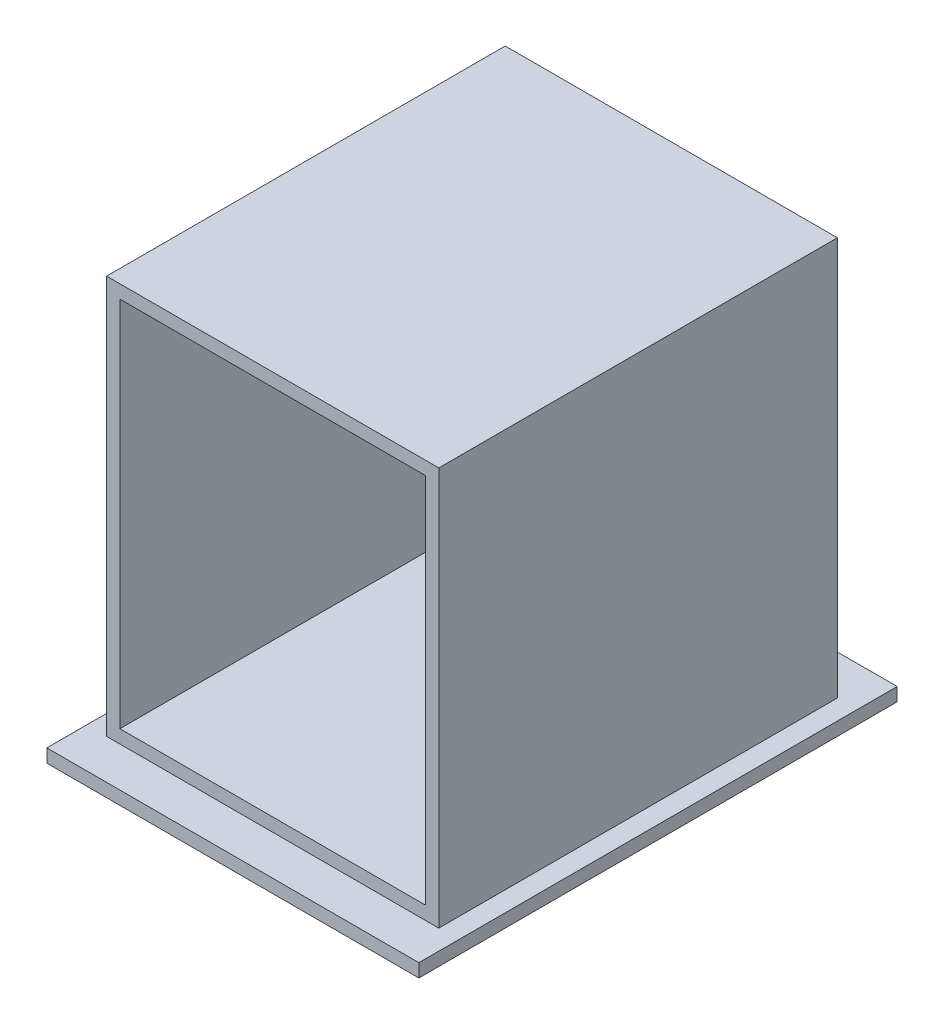
ISO-10303-21;
HEADER;
FILE_DESCRIPTION(('STEP AP214'),'2;1');
FILE_NAME('part.step','',(''),(''),'','','');
FILE_SCHEMA(('AUTOMOTIVE_DESIGN { 1 0 10303 214 1 1 1 1 }'));
ENDSEC;
DATA;
#1=APPLICATION_CONTEXT('core data for automotive mechanical design processes');
#2=APPLICATION_PROTOCOL_DEFINITION('international standard','automotive_design',2000,#1);
#3=PRODUCT_CONTEXT('',#1,'mechanical');
#4=PRODUCT('Part','Part','',(#3));
#5=PRODUCT_RELATED_PRODUCT_CATEGORY('part','',(#4));
#6=PRODUCT_DEFINITION_FORMATION('','',#4);
#7=PRODUCT_DEFINITION_CONTEXT('part definition',#1,'design');
#8=PRODUCT_DEFINITION('design','',#6,#7);
#9=PRODUCT_DEFINITION_SHAPE('','',#8);
#10=(LENGTH_UNIT() NAMED_UNIT(*) SI_UNIT(.MILLI.,.METRE.));
#11=(NAMED_UNIT(*) PLANE_ANGLE_UNIT() SI_UNIT($,.RADIAN.));
#12=(NAMED_UNIT(*) SI_UNIT($,.STERADIAN.) SOLID_ANGLE_UNIT());
#13=UNCERTAINTY_MEASURE_WITH_UNIT(LENGTH_MEASURE(1.E-05),#10,'distance_accuracy_value','');
#14=(GEOMETRIC_REPRESENTATION_CONTEXT(3) GLOBAL_UNCERTAINTY_ASSIGNED_CONTEXT((#13)) GLOBAL_UNIT_ASSIGNED_CONTEXT((#10,
#11,#12)) REPRESENTATION_CONTEXT('',''));
#15=CARTESIAN_POINT('',(0.,0.,0.));
#16=DIRECTION('',(0.,0.,1.));
#17=DIRECTION('',(1.,0.,0.));
#18=AXIS2_PLACEMENT_3D('',#15,#16,#17);
#19=CARTESIAN_POINT('',(0.,0.,300.));
#20=DIRECTION('',(1.,0.,0.));
#21=DIRECTION('',(0.,0.,-1.));
#22=AXIS2_PLACEMENT_3D('',#19,#20,#21);
#23=PLANE('',#22);
#24=DIRECTION('',(0.,-1.,0.));
#25=VECTOR('',#24,1.);
#26=CARTESIAN_POINT('',(0.,0.,0.));
#27=LINE('',#26,#25);
#28=CARTESIAN_POINT('',(0.,300.,0.));
#29=VERTEX_POINT('',#28);
#30=CARTESIAN_POINT('',(0.,0.,0.));
#31=VERTEX_POINT('',#30);
#32=EDGE_CURVE('E238',#29,#31,#27,.T.);
#33=ORIENTED_EDGE('',*,*,#32,.T.);
#34=DIRECTION('',(0.,0.,-1.));
#35=VECTOR('',#34,1.);
#36=CARTESIAN_POINT('',(0.,0.,300.));
#37=LINE('',#36,#35);
#38=CARTESIAN_POINT('',(0.,0.,300.));
#39=VERTEX_POINT('',#38);
#40=EDGE_CURVE('E11',#39,#31,#37,.T.);
#41=ORIENTED_EDGE('',*,*,#40,.F.);
#42=DIRECTION('',(0.,-1.,0.));
#43=VECTOR('',#42,1.);
#44=CARTESIAN_POINT('',(0.,0.,300.));
#45=LINE('',#44,#43);
#46=CARTESIAN_POINT('',(0.,300.,300.));
#47=VERTEX_POINT('',#46);
#48=EDGE_CURVE('E244',#47,#39,#45,.T.);
#49=ORIENTED_EDGE('',*,*,#48,.F.);
#50=DIRECTION('',(0.,0.,-1.));
#51=VECTOR('',#50,1.);
#52=CARTESIAN_POINT('',(0.,300.,300.));
#53=LINE('',#52,#51);
#54=EDGE_CURVE('E253',#47,#29,#53,.T.);
#55=ORIENTED_EDGE('',*,*,#54,.T.);
#56=EDGE_LOOP('',(#33,#41,#49,#55));
#57=FACE_BOUND('',#56,.T.);
#58=ADVANCED_FACE('F33',(#57),#23,.F.);
#59=CARTESIAN_POINT('',(250.,0.,300.));
#60=DIRECTION('',(-1.,0.,0.));
#61=DIRECTION('',(0.,-1.,0.));
#62=AXIS2_PLACEMENT_3D('',#59,#60,#61);
#63=PLANE('',#62);
#64=DIRECTION('',(0.,1.,0.));
#65=VECTOR('',#64,1.);
#66=CARTESIAN_POINT('',(250.,0.,0.));
#67=LINE('',#66,#65);
#68=CARTESIAN_POINT('',(250.,0.,0.));
#69=VERTEX_POINT('',#68);
#70=CARTESIAN_POINT('',(250.,300.,0.));
#71=VERTEX_POINT('',#70);
#72=EDGE_CURVE('E258',#69,#71,#67,.T.);
#73=ORIENTED_EDGE('',*,*,#72,.T.);
#74=DIRECTION('',(0.,0.,-1.));
#75=VECTOR('',#74,1.);
#76=CARTESIAN_POINT('',(250.,300.,300.));
#77=LINE('',#76,#75);
#78=CARTESIAN_POINT('',(250.,300.,300.));
#79=VERTEX_POINT('',#78);
#80=EDGE_CURVE('E263',#79,#71,#77,.T.);
#81=ORIENTED_EDGE('',*,*,#80,.F.);
#82=DIRECTION('',(0.,1.,0.));
#83=VECTOR('',#82,1.);
#84=CARTESIAN_POINT('',(250.,0.,300.));
#85=LINE('',#84,#83);
#86=CARTESIAN_POINT('',(250.,0.,300.));
#87=VERTEX_POINT('',#86);
#88=EDGE_CURVE('E249',#87,#79,#85,.T.);
#89=ORIENTED_EDGE('',*,*,#88,.F.);
#90=DIRECTION('',(0.,0.,-1.));
#91=VECTOR('',#90,1.);
#92=CARTESIAN_POINT('',(250.,0.,300.));
#93=LINE('',#92,#91);
#94=EDGE_CURVE('E40',#87,#69,#93,.T.);
#95=ORIENTED_EDGE('',*,*,#94,.T.);
#96=EDGE_LOOP('',(#73,#81,#89,#95));
#97=FACE_BOUND('',#96,.T.);
#98=ADVANCED_FACE('F269',(#97),#63,.F.);
#99=CARTESIAN_POINT('',(0.,300.,300.));
#100=DIRECTION('',(0.,-1.,0.));
#101=DIRECTION('',(0.,0.,-1.));
#102=AXIS2_PLACEMENT_3D('',#99,#100,#101);
#103=PLANE('',#102);
#104=DIRECTION('',(-1.,0.,0.));
#105=VECTOR('',#104,1.);
#106=CARTESIAN_POINT('',(0.,300.,0.));
#107=LINE('',#106,#105);
#108=EDGE_CURVE('E247',#71,#29,#107,.T.);
#109=ORIENTED_EDGE('',*,*,#108,.T.);
#110=ORIENTED_EDGE('',*,*,#54,.F.);
#111=DIRECTION('',(-1.,0.,0.));
#112=VECTOR('',#111,1.);
#113=CARTESIAN_POINT('',(0.,300.,300.));
#114=LINE('',#113,#112);
#115=EDGE_CURVE('E251',#79,#47,#114,.T.);
#116=ORIENTED_EDGE('',*,*,#115,.F.);
#117=ORIENTED_EDGE('',*,*,#80,.T.);
#118=EDGE_LOOP('',(#109,#110,#116,#117));
#119=FACE_BOUND('',#118,.T.);
#120=ADVANCED_FACE('F285',(#119),#103,.F.);
#121=CARTESIAN_POINT('',(0.,0.,300.));
#122=DIRECTION('',(0.,0.,-1.));
#123=DIRECTION('',(-1.,0.,0.));
#124=AXIS2_PLACEMENT_3D('',#121,#122,#123);
#125=PLANE('',#124);
#126=DIRECTION('',(1.,0.,0.));
#127=VECTOR('',#126,1.);
#128=CARTESIAN_POINT('',(10.,10.,300.));
#129=LINE('',#128,#127);
#130=CARTESIAN_POINT('',(10.,10.,300.));
#131=VERTEX_POINT('',#130);
#132=CARTESIAN_POINT('',(240.,10.,300.));
#133=VERTEX_POINT('',#132);
#134=EDGE_CURVE('E228',#131,#133,#129,.T.);
#135=ORIENTED_EDGE('',*,*,#134,.F.);
#136=DIRECTION('',(0.,-1.,0.));
#137=VECTOR('',#136,1.);
#138=CARTESIAN_POINT('',(10.,10.,300.));
#139=LINE('',#138,#137);
#140=CARTESIAN_POINT('',(10.,290.,300.));
#141=VERTEX_POINT('',#140);
#142=EDGE_CURVE('E55',#141,#131,#139,.T.);
#143=ORIENTED_EDGE('',*,*,#142,.F.);
#144=DIRECTION('',(-1.,0.,0.));
#145=VECTOR('',#144,1.);
#146=CARTESIAN_POINT('',(10.,290.,300.));
#147=LINE('',#146,#145);
#148=CARTESIAN_POINT('',(240.,290.,300.));
#149=VERTEX_POINT('',#148);
#150=EDGE_CURVE('E217',#149,#141,#147,.T.);
#151=ORIENTED_EDGE('',*,*,#150,.F.);
#152=DIRECTION('',(0.,1.,0.));
#153=VECTOR('',#152,1.);
#154=CARTESIAN_POINT('',(240.,10.,300.));
#155=LINE('',#154,#153);
#156=EDGE_CURVE('E231',#133,#149,#155,.T.);
#157=ORIENTED_EDGE('',*,*,#156,.F.);
#158=EDGE_LOOP('',(#135,#143,#151,#157));
#159=FACE_BOUND('',#158,.T.);
#160=ORIENTED_EDGE('',*,*,#48,.T.);
#161=DIRECTION('',(1.,0.,0.));
#162=VECTOR('',#161,1.);
#163=CARTESIAN_POINT('',(0.,0.,300.));
#164=LINE('',#163,#162);
#165=EDGE_CURVE('E246',#39,#87,#164,.T.);
#166=ORIENTED_EDGE('',*,*,#165,.T.);
#167=ORIENTED_EDGE('',*,*,#88,.T.);
#168=ORIENTED_EDGE('',*,*,#115,.T.);
#169=EDGE_LOOP('',(#160,#166,#167,#168));
#170=FACE_BOUND('',#169,.T.);
#171=ADVANCED_FACE('F287',(#159,#170),#125,.F.);
#172=CARTESIAN_POINT('',(0.,0.,0.));
#173=DIRECTION('',(0.,0.,-1.));
#174=DIRECTION('',(-1.,0.,0.));
#175=AXIS2_PLACEMENT_3D('',#172,#173,#174);
#176=PLANE('',#175);
#177=ORIENTED_EDGE('',*,*,#32,.F.);
#178=ORIENTED_EDGE('',*,*,#108,.F.);
#179=ORIENTED_EDGE('',*,*,#72,.F.);
#180=DIRECTION('',(1.,0.,0.));
#181=VECTOR('',#180,1.);
#182=CARTESIAN_POINT('',(0.,0.,0.));
#183=LINE('',#182,#181);
#184=EDGE_CURVE('E255',#31,#69,#183,.T.);
#185=ORIENTED_EDGE('',*,*,#184,.F.);
#186=EDGE_LOOP('',(#177,#178,#179,#185));
#187=FACE_BOUND('',#186,.T.);
#188=ADVANCED_FACE('F277',(#187),#176,.T.);
#189=CARTESIAN_POINT('',(10.,10.,10.));
#190=DIRECTION('',(-1.,0.,0.));
#191=DIRECTION('',(0.,-1.,0.));
#192=AXIS2_PLACEMENT_3D('',#189,#190,#191);
#193=PLANE('',#192);
#194=ORIENTED_EDGE('',*,*,#142,.T.);
#195=DIRECTION('',(0.,0.,1.));
#196=VECTOR('',#195,1.);
#197=CARTESIAN_POINT('',(10.,10.,10.));
#198=LINE('',#197,#196);
#199=CARTESIAN_POINT('',(10.,10.,10.));
#200=VERTEX_POINT('',#199);
#201=EDGE_CURVE('E226',#200,#131,#198,.T.);
#202=ORIENTED_EDGE('',*,*,#201,.F.);
#203=DIRECTION('',(0.,-1.,0.));
#204=VECTOR('',#203,1.);
#205=CARTESIAN_POINT('',(10.,10.,10.));
#206=LINE('',#205,#204);
#207=CARTESIAN_POINT('',(10.,290.,10.));
#208=VERTEX_POINT('',#207);
#209=EDGE_CURVE('E213',#208,#200,#206,.T.);
#210=ORIENTED_EDGE('',*,*,#209,.F.);
#211=DIRECTION('',(0.,0.,1.));
#212=VECTOR('',#211,1.);
#213=CARTESIAN_POINT('',(10.,290.,10.));
#214=LINE('',#213,#212);
#215=EDGE_CURVE('E236',#208,#141,#214,.T.);
#216=ORIENTED_EDGE('',*,*,#215,.T.);
#217=EDGE_LOOP('',(#194,#202,#210,#216));
#218=FACE_BOUND('',#217,.T.);
#219=ADVANCED_FACE('F295',(#218),#193,.F.);
#220=CARTESIAN_POINT('',(10.,290.,10.));
#221=DIRECTION('',(0.,1.,0.));
#222=DIRECTION('',(0.,0.,1.));
#223=AXIS2_PLACEMENT_3D('',#220,#221,#222);
#224=PLANE('',#223);
#225=ORIENTED_EDGE('',*,*,#150,.T.);
#226=ORIENTED_EDGE('',*,*,#215,.F.);
#227=DIRECTION('',(-1.,0.,0.));
#228=VECTOR('',#227,1.);
#229=CARTESIAN_POINT('',(10.,290.,10.));
#230=LINE('',#229,#228);
#231=CARTESIAN_POINT('',(240.,290.,10.));
#232=VERTEX_POINT('',#231);
#233=EDGE_CURVE('E223',#232,#208,#230,.T.);
#234=ORIENTED_EDGE('',*,*,#233,.F.);
#235=DIRECTION('',(0.,0.,1.));
#236=VECTOR('',#235,1.);
#237=CARTESIAN_POINT('',(240.,290.,10.));
#238=LINE('',#237,#236);
#239=EDGE_CURVE('E239',#232,#149,#238,.T.);
#240=ORIENTED_EDGE('',*,*,#239,.T.);
#241=EDGE_LOOP('',(#225,#226,#234,#240));
#242=FACE_BOUND('',#241,.T.);
#243=ADVANCED_FACE('F333',(#242),#224,.F.);
#244=CARTESIAN_POINT('',(240.,10.,10.));
#245=DIRECTION('',(1.,0.,0.));
#246=DIRECTION('',(0.,0.,-1.));
#247=AXIS2_PLACEMENT_3D('',#244,#245,#246);
#248=PLANE('',#247);
#249=ORIENTED_EDGE('',*,*,#156,.T.);
#250=ORIENTED_EDGE('',*,*,#239,.F.);
#251=DIRECTION('',(0.,1.,0.));
#252=VECTOR('',#251,1.);
#253=CARTESIAN_POINT('',(240.,10.,10.));
#254=LINE('',#253,#252);
#255=CARTESIAN_POINT('',(240.,10.,10.));
#256=VERTEX_POINT('',#255);
#257=EDGE_CURVE('E220',#256,#232,#254,.T.);
#258=ORIENTED_EDGE('',*,*,#257,.F.);
#259=DIRECTION('',(0.,0.,1.));
#260=VECTOR('',#259,1.);
#261=CARTESIAN_POINT('',(240.,10.,10.));
#262=LINE('',#261,#260);
#263=EDGE_CURVE('E241',#256,#133,#262,.T.);
#264=ORIENTED_EDGE('',*,*,#263,.T.);
#265=EDGE_LOOP('',(#249,#250,#258,#264));
#266=FACE_BOUND('',#265,.T.);
#267=ADVANCED_FACE('F338',(#266),#248,.F.);
#268=CARTESIAN_POINT('',(10.,10.,10.));
#269=DIRECTION('',(0.,-1.,0.));
#270=DIRECTION('',(0.,0.,-1.));
#271=AXIS2_PLACEMENT_3D('',#268,#269,#270);
#272=PLANE('',#271);
#273=ORIENTED_EDGE('',*,*,#134,.T.);
#274=ORIENTED_EDGE('',*,*,#263,.F.);
#275=DIRECTION('',(1.,0.,0.));
#276=VECTOR('',#275,1.);
#277=CARTESIAN_POINT('',(10.,10.,10.));
#278=LINE('',#277,#276);
#279=EDGE_CURVE('E216',#200,#256,#278,.T.);
#280=ORIENTED_EDGE('',*,*,#279,.F.);
#281=ORIENTED_EDGE('',*,*,#201,.T.);
#282=EDGE_LOOP('',(#273,#274,#280,#281));
#283=FACE_BOUND('',#282,.T.);
#284=ADVANCED_FACE('F346',(#283),#272,.F.);
#285=CARTESIAN_POINT('',(0.,0.,10.));
#286=DIRECTION('',(0.,0.,-1.));
#287=DIRECTION('',(-1.,0.,0.));
#288=AXIS2_PLACEMENT_3D('',#285,#286,#287);
#289=PLANE('',#288);
#290=ORIENTED_EDGE('',*,*,#209,.T.);
#291=ORIENTED_EDGE('',*,*,#279,.T.);
#292=ORIENTED_EDGE('',*,*,#257,.T.);
#293=ORIENTED_EDGE('',*,*,#233,.T.);
#294=EDGE_LOOP('',(#290,#291,#292,#293));
#295=FACE_BOUND('',#294,.T.);
#296=ADVANCED_FACE('F354',(#295),#289,.F.);
#297=CARTESIAN_POINT('',(0.,0.,0.));
#298=DIRECTION('',(0.,-1.,0.));
#299=DIRECTION('',(0.,0.,-1.));
#300=AXIS2_PLACEMENT_3D('',#297,#298,#299);
#301=PLANE('',#300);
#302=DIRECTION('',(0.,0.,-1.));
#303=VECTOR('',#302,1.);
#304=CARTESIAN_POINT('',(-15.,0.,330.));
#305=LINE('',#304,#303);
#306=CARTESIAN_POINT('',(-15.,0.,330.));
#307=VERTEX_POINT('',#306);
#308=CARTESIAN_POINT('',(-15.,0.,-30.));
#309=VERTEX_POINT('',#308);
#310=EDGE_CURVE('E180',#307,#309,#305,.T.);
#311=ORIENTED_EDGE('',*,*,#310,.F.);
#312=DIRECTION('',(-1.,0.,0.));
#313=VECTOR('',#312,1.);
#314=CARTESIAN_POINT('',(-15.,0.,330.));
#315=LINE('',#314,#313);
#316=CARTESIAN_POINT('',(265.,0.,330.));
#317=VERTEX_POINT('',#316);
#318=EDGE_CURVE('E188',#317,#307,#315,.T.);
#319=ORIENTED_EDGE('',*,*,#318,.F.);
#320=DIRECTION('',(0.,0.,1.));
#321=VECTOR('',#320,1.);
#322=CARTESIAN_POINT('',(265.,0.,330.));
#323=LINE('',#322,#321);
#324=CARTESIAN_POINT('',(265.,0.,-30.));
#325=VERTEX_POINT('',#324);
#326=EDGE_CURVE('E199',#325,#317,#323,.T.);
#327=ORIENTED_EDGE('',*,*,#326,.F.);
#328=DIRECTION('',(1.,0.,0.));
#329=VECTOR('',#328,1.);
#330=CARTESIAN_POINT('',(-15.,0.,-30.));
#331=LINE('',#330,#329);
#332=EDGE_CURVE('E197',#309,#325,#331,.T.);
#333=ORIENTED_EDGE('',*,*,#332,.F.);
#334=EDGE_LOOP('',(#311,#319,#327,#333));
#335=FACE_BOUND('',#334,.T.);
#336=ORIENTED_EDGE('',*,*,#40,.T.);
#337=ORIENTED_EDGE('',*,*,#184,.T.);
#338=ORIENTED_EDGE('',*,*,#94,.F.);
#339=ORIENTED_EDGE('',*,*,#165,.F.);
#340=EDGE_LOOP('',(#336,#337,#338,#339));
#341=FACE_BOUND('',#340,.T.);
#342=ADVANCED_FACE('F278',(#335,#341),#301,.F.);
#343=CARTESIAN_POINT('',(-15.,-10.,330.));
#344=DIRECTION('',(1.,0.,0.));
#345=DIRECTION('',(0.,0.,-1.));
#346=AXIS2_PLACEMENT_3D('',#343,#344,#345);
#347=PLANE('',#346);
#348=ORIENTED_EDGE('',*,*,#310,.T.);
#349=DIRECTION('',(0.,1.,0.));
#350=VECTOR('',#349,1.);
#351=CARTESIAN_POINT('',(-15.,-10.,-30.));
#352=LINE('',#351,#350);
#353=CARTESIAN_POINT('',(-15.,-10.,-30.));
#354=VERTEX_POINT('',#353);
#355=EDGE_CURVE('E210',#354,#309,#352,.T.);
#356=ORIENTED_EDGE('',*,*,#355,.F.);
#357=DIRECTION('',(0.,0.,-1.));
#358=VECTOR('',#357,1.);
#359=CARTESIAN_POINT('',(-15.,-10.,330.));
#360=LINE('',#359,#358);
#361=CARTESIAN_POINT('',(-15.,-10.,330.));
#362=VERTEX_POINT('',#361);
#363=EDGE_CURVE('E184',#362,#354,#360,.T.);
#364=ORIENTED_EDGE('',*,*,#363,.F.);
#365=DIRECTION('',(0.,1.,0.));
#366=VECTOR('',#365,1.);
#367=CARTESIAN_POINT('',(-15.,-10.,330.));
#368=LINE('',#367,#366);
#369=EDGE_CURVE('E194',#362,#307,#368,.T.);
#370=ORIENTED_EDGE('',*,*,#369,.T.);
#371=EDGE_LOOP('',(#348,#356,#364,#370));
#372=FACE_BOUND('',#371,.T.);
#373=ADVANCED_FACE('F367',(#372),#347,.F.);
#374=CARTESIAN_POINT('',(-15.,-10.,-30.));
#375=DIRECTION('',(0.,0.,1.));
#376=DIRECTION('',(1.,0.,0.));
#377=AXIS2_PLACEMENT_3D('',#374,#375,#376);
#378=PLANE('',#377);
#379=ORIENTED_EDGE('',*,*,#332,.T.);
#380=DIRECTION('',(0.,1.,0.));
#381=VECTOR('',#380,1.);
#382=CARTESIAN_POINT('',(265.,-10.,-30.));
#383=LINE('',#382,#381);
#384=CARTESIAN_POINT('',(265.,-10.,-30.));
#385=VERTEX_POINT('',#384);
#386=EDGE_CURVE('E207',#385,#325,#383,.T.);
#387=ORIENTED_EDGE('',*,*,#386,.F.);
#388=DIRECTION('',(1.,0.,0.));
#389=VECTOR('',#388,1.);
#390=CARTESIAN_POINT('',(-15.,-10.,-30.));
#391=LINE('',#390,#389);
#392=EDGE_CURVE('E187',#354,#385,#391,.T.);
#393=ORIENTED_EDGE('',*,*,#392,.F.);
#394=ORIENTED_EDGE('',*,*,#355,.T.);
#395=EDGE_LOOP('',(#379,#387,#393,#394));
#396=FACE_BOUND('',#395,.T.);
#397=ADVANCED_FACE('F375',(#396),#378,.F.);
#398=CARTESIAN_POINT('',(265.,-10.,330.));
#399=DIRECTION('',(-1.,0.,0.));
#400=DIRECTION('',(0.,0.,1.));
#401=AXIS2_PLACEMENT_3D('',#398,#399,#400);
#402=PLANE('',#401);
#403=ORIENTED_EDGE('',*,*,#326,.T.);
#404=DIRECTION('',(0.,1.,0.));
#405=VECTOR('',#404,1.);
#406=CARTESIAN_POINT('',(265.,-10.,330.));
#407=LINE('',#406,#405);
#408=CARTESIAN_POINT('',(265.,-10.,330.));
#409=VERTEX_POINT('',#408);
#410=EDGE_CURVE('E204',#409,#317,#407,.T.);
#411=ORIENTED_EDGE('',*,*,#410,.F.);
#412=DIRECTION('',(0.,0.,1.));
#413=VECTOR('',#412,1.);
#414=CARTESIAN_POINT('',(265.,-10.,330.));
#415=LINE('',#414,#413);
#416=EDGE_CURVE('E190',#385,#409,#415,.T.);
#417=ORIENTED_EDGE('',*,*,#416,.F.);
#418=ORIENTED_EDGE('',*,*,#386,.T.);
#419=EDGE_LOOP('',(#403,#411,#417,#418));
#420=FACE_BOUND('',#419,.T.);
#421=ADVANCED_FACE('F383',(#420),#402,.F.);
#422=CARTESIAN_POINT('',(-15.,-10.,330.));
#423=DIRECTION('',(0.,0.,-1.));
#424=DIRECTION('',(-1.,0.,0.));
#425=AXIS2_PLACEMENT_3D('',#422,#423,#424);
#426=PLANE('',#425);
#427=ORIENTED_EDGE('',*,*,#318,.T.);
#428=ORIENTED_EDGE('',*,*,#369,.F.);
#429=DIRECTION('',(-1.,0.,0.));
#430=VECTOR('',#429,1.);
#431=CARTESIAN_POINT('',(-15.,-10.,330.));
#432=LINE('',#431,#430);
#433=EDGE_CURVE('E192',#409,#362,#432,.T.);
#434=ORIENTED_EDGE('',*,*,#433,.F.);
#435=ORIENTED_EDGE('',*,*,#410,.T.);
#436=EDGE_LOOP('',(#427,#428,#434,#435));
#437=FACE_BOUND('',#436,.T.);
#438=ADVANCED_FACE('F391',(#437),#426,.F.);
#439=CARTESIAN_POINT('',(0.,-10.,0.));
#440=DIRECTION('',(0.,-1.,0.));
#441=DIRECTION('',(0.,0.,-1.));
#442=AXIS2_PLACEMENT_3D('',#439,#440,#441);
#443=PLANE('',#442);
#444=CARTESIAN_POINT('',(92.0112341406634,-10.,270.));
#445=DIRECTION('',(0.,-1.,0.));
#446=DIRECTION('',(0.,0.,-1.));
#447=AXIS2_PLACEMENT_3D('',#444,#445,#446);
#448=CIRCLE('',#447,14.2192956290245);
#449=CARTESIAN_POINT('',(92.0112341406634,-10.,284.219295629024));
#450=VERTEX_POINT('',#449);
#451=CARTESIAN_POINT('',(92.0112341406634,-10.,255.780704370975));
#452=VERTEX_POINT('',#451);
#453=EDGE_CURVE('E47',#450,#452,#448,.T.);
#454=ORIENTED_EDGE('',*,*,#453,.F.);
#455=DIRECTION('',(-1.,0.,0.));
#456=VECTOR('',#455,1.);
#457=CARTESIAN_POINT('',(92.0112341406634,-10.,284.219295629024));
#458=LINE('',#457,#456);
#459=CARTESIAN_POINT('',(173.345605138683,-10.,284.219295629024));
#460=VERTEX_POINT('',#459);
#461=EDGE_CURVE('E165',#460,#450,#458,.T.);
#462=ORIENTED_EDGE('',*,*,#461,.F.);
#463=CARTESIAN_POINT('',(173.345605138683,-10.,270.));
#464=DIRECTION('',(0.,-1.,0.));
#465=DIRECTION('',(0.,0.,-1.));
#466=AXIS2_PLACEMENT_3D('',#463,#464,#465);
#467=CIRCLE('',#466,14.2192956290245);
#468=CARTESIAN_POINT('',(173.345605138683,-10.,255.780704370975));
#469=VERTEX_POINT('',#468);
#470=EDGE_CURVE('E168',#469,#460,#467,.T.);
#471=ORIENTED_EDGE('',*,*,#470,.F.);
#472=DIRECTION('',(1.,0.,0.));
#473=VECTOR('',#472,1.);
#474=CARTESIAN_POINT('',(92.0112341406634,-10.,255.780704370975));
#475=LINE('',#474,#473);
#476=EDGE_CURVE('E174',#452,#469,#475,.T.);
#477=ORIENTED_EDGE('',*,*,#476,.F.);
#478=EDGE_LOOP('',(#454,#462,#471,#477));
#479=FACE_BOUND('',#478,.T.);
#480=ORIENTED_EDGE('',*,*,#363,.T.);
#481=ORIENTED_EDGE('',*,*,#392,.T.);
#482=ORIENTED_EDGE('',*,*,#416,.T.);
#483=ORIENTED_EDGE('',*,*,#433,.T.);
#484=EDGE_LOOP('',(#480,#481,#482,#483));
#485=FACE_BOUND('',#484,.T.);
#486=ADVANCED_FACE('F399',(#479,#485),#443,.T.);
#487=CARTESIAN_POINT('',(92.0112341406634,0.,270.));
#488=DIRECTION('',(0.,-1.,0.));
#489=DIRECTION('',(0.,0.,-1.));
#490=AXIS2_PLACEMENT_3D('',#487,#488,#489);
#491=CYLINDRICAL_SURFACE('',#490,14.2192956290245);
#492=ORIENTED_EDGE('',*,*,#453,.T.);
#493=DIRECTION('',(0.,-1.,0.));
#494=VECTOR('',#493,1.);
#495=CARTESIAN_POINT('',(92.0112341406634,0.,255.780704370975));
#496=LINE('',#495,#494);
#497=CARTESIAN_POINT('',(92.0112341406634,0.,255.780704370975));
#498=VERTEX_POINT('',#497);
#499=EDGE_CURVE('E143',#498,#452,#496,.T.);
#500=ORIENTED_EDGE('',*,*,#499,.F.);
#501=CARTESIAN_POINT('',(92.0112341406634,0.,270.));
#502=DIRECTION('',(0.,-1.,0.));
#503=DIRECTION('',(0.,0.,-1.));
#504=AXIS2_PLACEMENT_3D('',#501,#502,#503);
#505=CIRCLE('',#504,14.2192956290245);
#506=CARTESIAN_POINT('',(92.0112341406634,0.,284.219295629024));
#507=VERTEX_POINT('',#506);
#508=EDGE_CURVE('E147',#507,#498,#505,.T.);
#509=ORIENTED_EDGE('',*,*,#508,.F.);
#510=DIRECTION('',(0.,-1.,0.));
#511=VECTOR('',#510,1.);
#512=CARTESIAN_POINT('',(92.0112341406634,0.,284.219295629024));
#513=LINE('',#512,#511);
#514=EDGE_CURVE('E178',#507,#450,#513,.T.);
#515=ORIENTED_EDGE('',*,*,#514,.T.);
#516=EDGE_LOOP('',(#492,#500,#509,#515));
#517=FACE_BOUND('',#516,.T.);
#518=ADVANCED_FACE('F145',(#517),#491,.F.);
#519=CARTESIAN_POINT('',(92.0112341406634,0.,284.219295629024));
#520=DIRECTION('',(0.,0.,1.));
#521=DIRECTION('',(1.,0.,0.));
#522=AXIS2_PLACEMENT_3D('',#519,#520,#521);
#523=PLANE('',#522);
#524=ORIENTED_EDGE('',*,*,#461,.T.);
#525=ORIENTED_EDGE('',*,*,#514,.F.);
#526=DIRECTION('',(-1.,0.,0.));
#527=VECTOR('',#526,1.);
#528=CARTESIAN_POINT('',(92.0112341406634,0.,284.219295629024));
#529=LINE('',#528,#527);
#530=CARTESIAN_POINT('',(173.345605138683,0.,284.219295629024));
#531=VERTEX_POINT('',#530);
#532=EDGE_CURVE('E153',#531,#507,#529,.T.);
#533=ORIENTED_EDGE('',*,*,#532,.F.);
#534=DIRECTION('',(0.,-1.,0.));
#535=VECTOR('',#534,1.);
#536=CARTESIAN_POINT('',(173.345605138683,0.,284.219295629024));
#537=LINE('',#536,#535);
#538=EDGE_CURVE('E181',#531,#460,#537,.T.);
#539=ORIENTED_EDGE('',*,*,#538,.T.);
#540=EDGE_LOOP('',(#524,#525,#533,#539));
#541=FACE_BOUND('',#540,.T.);
#542=ADVANCED_FACE('F417',(#541),#523,.F.);
#543=CARTESIAN_POINT('',(173.345605138683,0.,270.));
#544=DIRECTION('',(0.,-1.,0.));
#545=DIRECTION('',(0.,0.,-1.));
#546=AXIS2_PLACEMENT_3D('',#543,#544,#545);
#547=CYLINDRICAL_SURFACE('',#546,14.2192956290245);
#548=ORIENTED_EDGE('',*,*,#470,.T.);
#549=ORIENTED_EDGE('',*,*,#538,.F.);
#550=CARTESIAN_POINT('',(173.345605138683,0.,270.));
#551=DIRECTION('',(0.,-1.,0.));
#552=DIRECTION('',(0.,0.,-1.));
#553=AXIS2_PLACEMENT_3D('',#550,#551,#552);
#554=CIRCLE('',#553,14.2192956290245);
#555=CARTESIAN_POINT('',(173.345605138683,0.,255.780704370975));
#556=VERTEX_POINT('',#555);
#557=EDGE_CURVE('E161',#556,#531,#554,.T.);
#558=ORIENTED_EDGE('',*,*,#557,.F.);
#559=DIRECTION('',(0.,-1.,0.));
#560=VECTOR('',#559,1.);
#561=CARTESIAN_POINT('',(173.345605138683,0.,255.780704370975));
#562=LINE('',#561,#560);
#563=EDGE_CURVE('E152',#556,#469,#562,.T.);
#564=ORIENTED_EDGE('',*,*,#563,.T.);
#565=EDGE_LOOP('',(#548,#549,#558,#564));
#566=FACE_BOUND('',#565,.T.);
#567=ADVANCED_FACE('F423',(#566),#547,.F.);
#568=CARTESIAN_POINT('',(92.0112341406634,0.,255.780704370975));
#569=DIRECTION('',(0.,0.,-1.));
#570=DIRECTION('',(-1.,0.,0.));
#571=AXIS2_PLACEMENT_3D('',#568,#569,#570);
#572=PLANE('',#571);
#573=ORIENTED_EDGE('',*,*,#476,.T.);
#574=ORIENTED_EDGE('',*,*,#563,.F.);
#575=DIRECTION('',(1.,0.,0.));
#576=VECTOR('',#575,1.);
#577=CARTESIAN_POINT('',(92.0112341406634,0.,255.780704370975));
#578=LINE('',#577,#576);
#579=EDGE_CURVE('E156',#498,#556,#578,.T.);
#580=ORIENTED_EDGE('',*,*,#579,.F.);
#581=ORIENTED_EDGE('',*,*,#499,.T.);
#582=EDGE_LOOP('',(#573,#574,#580,#581));
#583=FACE_BOUND('',#582,.T.);
#584=ADVANCED_FACE('F157',(#583),#572,.F.);
#585=CARTESIAN_POINT('',(92.0112341406634,0.,270.));
#586=DIRECTION('',(0.,-1.,0.));
#587=DIRECTION('',(0.,0.,-1.));
#588=AXIS2_PLACEMENT_3D('',#585,#586,#587);
#589=PLANE('',#588);
#590=ORIENTED_EDGE('',*,*,#508,.T.);
#591=ORIENTED_EDGE('',*,*,#579,.T.);
#592=ORIENTED_EDGE('',*,*,#557,.T.);
#593=ORIENTED_EDGE('',*,*,#532,.T.);
#594=EDGE_LOOP('',(#590,#591,#592,#593));
#595=FACE_BOUND('',#594,.T.);
#596=ADVANCED_FACE('F163',(#595),#589,.T.);
#597=CLOSED_SHELL('',(#58,#98,#120,#171,#188,#219,#243,#267,#284,#296,#342,#373,#397,#421,#438,
#486,#518,#542,#567,#584,#596));
#598=MANIFOLD_SOLID_BREP('B2',#597);
#599=ADVANCED_BREP_SHAPE_REPRESENTATION('',(#18,#598),#14);
#600=SHAPE_DEFINITION_REPRESENTATION(#9,#599);
ENDSEC;
END-ISO-10303-21;
